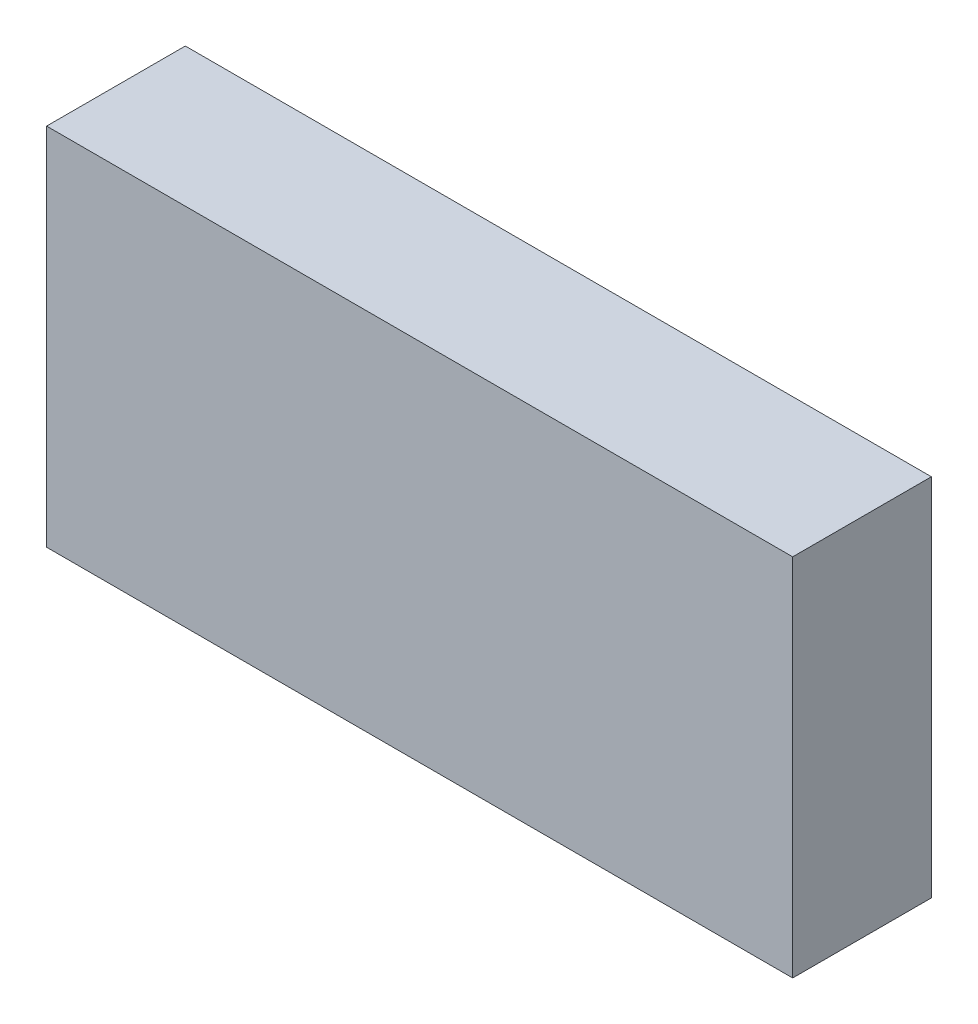
ISO-10303-21;
HEADER;
FILE_DESCRIPTION(('STEP AP214'),'2;1');
FILE_NAME('part.step','',(''),(''),'','','');
FILE_SCHEMA(('AUTOMOTIVE_DESIGN { 1 0 10303 214 1 1 1 1 }'));
ENDSEC;
DATA;
#1=APPLICATION_CONTEXT('core data for automotive mechanical design processes');
#2=APPLICATION_PROTOCOL_DEFINITION('international standard','automotive_design',2000,#1);
#3=PRODUCT_CONTEXT('',#1,'mechanical');
#4=PRODUCT('Part','Part','',(#3));
#5=PRODUCT_RELATED_PRODUCT_CATEGORY('part','',(#4));
#6=PRODUCT_DEFINITION_FORMATION('','',#4);
#7=PRODUCT_DEFINITION_CONTEXT('part definition',#1,'design');
#8=PRODUCT_DEFINITION('design','',#6,#7);
#9=PRODUCT_DEFINITION_SHAPE('','',#8);
#10=(LENGTH_UNIT() NAMED_UNIT(*) SI_UNIT(.MILLI.,.METRE.));
#11=(NAMED_UNIT(*) PLANE_ANGLE_UNIT() SI_UNIT($,.RADIAN.));
#12=(NAMED_UNIT(*) SI_UNIT($,.STERADIAN.) SOLID_ANGLE_UNIT());
#13=UNCERTAINTY_MEASURE_WITH_UNIT(LENGTH_MEASURE(1.E-05),#10,'distance_accuracy_value','');
#14=(GEOMETRIC_REPRESENTATION_CONTEXT(3) GLOBAL_UNCERTAINTY_ASSIGNED_CONTEXT((#13)) GLOBAL_UNIT_ASSIGNED_CONTEXT((#10,
#11,#12)) REPRESENTATION_CONTEXT('',''));
#15=CARTESIAN_POINT('',(0.,0.,0.));
#16=DIRECTION('',(0.,0.,1.));
#17=DIRECTION('',(1.,0.,0.));
#18=AXIS2_PLACEMENT_3D('',#15,#16,#17);
#19=CARTESIAN_POINT('',(1.143,0.5588,0.42499788));
#20=DIRECTION('',(0.,0.,-1.));
#21=DIRECTION('',(0.,-1.,0.));
#22=AXIS2_PLACEMENT_3D('',#19,#20,#21);
#23=PLANE('',#22);
#24=DIRECTION('',(-1.,0.,0.));
#25=VECTOR('',#24,1.);
#26=CARTESIAN_POINT('',(1.143,0.5588,0.42499788));
#27=LINE('',#26,#25);
#28=CARTESIAN_POINT('',(1.143,0.5588,0.42499788));
#29=VERTEX_POINT('',#28);
#30=CARTESIAN_POINT('',(-1.143,0.5588,0.42499788));
#31=VERTEX_POINT('',#30);
#32=EDGE_CURVE('E67',#29,#31,#27,.T.);
#33=ORIENTED_EDGE('',*,*,#32,.T.);
#34=DIRECTION('',(0.,-1.,0.));
#35=VECTOR('',#34,1.);
#36=CARTESIAN_POINT('',(-1.143,0.5588,0.42499788));
#37=LINE('',#36,#35);
#38=CARTESIAN_POINT('',(-1.143,-0.5588,0.42499788));
#39=VERTEX_POINT('',#38);
#40=EDGE_CURVE('E99',#31,#39,#37,.T.);
#41=ORIENTED_EDGE('',*,*,#40,.T.);
#42=DIRECTION('',(1.,0.,0.));
#43=VECTOR('',#42,1.);
#44=CARTESIAN_POINT('',(-1.143,-0.5588,0.42499788));
#45=LINE('',#44,#43);
#46=CARTESIAN_POINT('',(1.143,-0.5588,0.42499788));
#47=VERTEX_POINT('',#46);
#48=EDGE_CURVE('E70',#39,#47,#45,.T.);
#49=ORIENTED_EDGE('',*,*,#48,.T.);
#50=DIRECTION('',(0.,1.,0.));
#51=VECTOR('',#50,1.);
#52=CARTESIAN_POINT('',(1.143,-0.5588,0.42499788));
#53=LINE('',#52,#51);
#54=EDGE_CURVE('E11',#47,#29,#53,.T.);
#55=ORIENTED_EDGE('',*,*,#54,.T.);
#56=EDGE_LOOP('',(#33,#41,#49,#55));
#57=FACE_BOUND('',#56,.T.);
#58=ADVANCED_FACE('F17',(#57),#23,.F.);
#59=CARTESIAN_POINT('',(1.143,0.5588,0.));
#60=DIRECTION('',(0.,0.,-1.));
#61=DIRECTION('',(0.,-1.,0.));
#62=AXIS2_PLACEMENT_3D('',#59,#60,#61);
#63=PLANE('',#62);
#64=DIRECTION('',(-1.,0.,0.));
#65=VECTOR('',#64,1.);
#66=CARTESIAN_POINT('',(1.143,0.5588,0.));
#67=LINE('',#66,#65);
#68=CARTESIAN_POINT('',(1.143,0.5588,0.));
#69=VERTEX_POINT('',#68);
#70=CARTESIAN_POINT('',(-1.143,0.5588,0.));
#71=VERTEX_POINT('',#70);
#72=EDGE_CURVE('E84',#69,#71,#67,.T.);
#73=ORIENTED_EDGE('',*,*,#72,.F.);
#74=DIRECTION('',(0.,1.,0.));
#75=VECTOR('',#74,1.);
#76=CARTESIAN_POINT('',(1.143,-0.5588,0.));
#77=LINE('',#76,#75);
#78=CARTESIAN_POINT('',(1.143,-0.5588,0.));
#79=VERTEX_POINT('',#78);
#80=EDGE_CURVE('E28',#79,#69,#77,.T.);
#81=ORIENTED_EDGE('',*,*,#80,.F.);
#82=DIRECTION('',(1.,0.,0.));
#83=VECTOR('',#82,1.);
#84=CARTESIAN_POINT('',(-1.143,-0.5588,0.));
#85=LINE('',#84,#83);
#86=CARTESIAN_POINT('',(-1.143,-0.5588,0.));
#87=VERTEX_POINT('',#86);
#88=EDGE_CURVE('E93',#87,#79,#85,.T.);
#89=ORIENTED_EDGE('',*,*,#88,.F.);
#90=DIRECTION('',(0.,-1.,0.));
#91=VECTOR('',#90,1.);
#92=CARTESIAN_POINT('',(-1.143,0.5588,0.));
#93=LINE('',#92,#91);
#94=EDGE_CURVE('E80',#71,#87,#93,.T.);
#95=ORIENTED_EDGE('',*,*,#94,.F.);
#96=EDGE_LOOP('',(#73,#81,#89,#95));
#97=FACE_BOUND('',#96,.T.);
#98=ADVANCED_FACE('F156',(#97),#63,.T.);
#99=CARTESIAN_POINT('',(1.143,-0.5588,0.));
#100=DIRECTION('',(-1.,0.,0.));
#101=DIRECTION('',(0.,0.,1.));
#102=AXIS2_PLACEMENT_3D('',#99,#100,#101);
#103=PLANE('',#102);
#104=DIRECTION('',(0.,0.,1.));
#105=VECTOR('',#104,1.);
#106=CARTESIAN_POINT('',(1.143,-0.5588,0.));
#107=LINE('',#106,#105);
#108=EDGE_CURVE('E21',#79,#47,#107,.T.);
#109=ORIENTED_EDGE('',*,*,#108,.F.);
#110=ORIENTED_EDGE('',*,*,#80,.T.);
#111=DIRECTION('',(0.,0.,1.));
#112=VECTOR('',#111,1.);
#113=CARTESIAN_POINT('',(1.143,0.5588,0.));
#114=LINE('',#113,#112);
#115=EDGE_CURVE('E76',#69,#29,#114,.T.);
#116=ORIENTED_EDGE('',*,*,#115,.T.);
#117=ORIENTED_EDGE('',*,*,#54,.F.);
#118=EDGE_LOOP('',(#109,#110,#116,#117));
#119=FACE_BOUND('',#118,.T.);
#120=ADVANCED_FACE('F81',(#119),#103,.F.);
#121=CARTESIAN_POINT('',(-1.143,-0.5588,0.));
#122=DIRECTION('',(0.,1.,0.));
#123=DIRECTION('',(1.,0.,0.));
#124=AXIS2_PLACEMENT_3D('',#121,#122,#123);
#125=PLANE('',#124);
#126=DIRECTION('',(0.,0.,1.));
#127=VECTOR('',#126,1.);
#128=CARTESIAN_POINT('',(-1.143,-0.5588,0.));
#129=LINE('',#128,#127);
#130=EDGE_CURVE('E97',#87,#39,#129,.T.);
#131=ORIENTED_EDGE('',*,*,#130,.F.);
#132=ORIENTED_EDGE('',*,*,#88,.T.);
#133=ORIENTED_EDGE('',*,*,#108,.T.);
#134=ORIENTED_EDGE('',*,*,#48,.F.);
#135=EDGE_LOOP('',(#131,#132,#133,#134));
#136=FACE_BOUND('',#135,.T.);
#137=ADVANCED_FACE('F19',(#136),#125,.F.);
#138=CARTESIAN_POINT('',(-1.143,0.5588,0.));
#139=DIRECTION('',(1.,0.,0.));
#140=DIRECTION('',(0.,1.,0.));
#141=AXIS2_PLACEMENT_3D('',#138,#139,#140);
#142=PLANE('',#141);
#143=DIRECTION('',(0.,0.,1.));
#144=VECTOR('',#143,1.);
#145=CARTESIAN_POINT('',(-1.143,0.5588,0.));
#146=LINE('',#145,#144);
#147=EDGE_CURVE('E78',#71,#31,#146,.T.);
#148=ORIENTED_EDGE('',*,*,#147,.F.);
#149=ORIENTED_EDGE('',*,*,#94,.T.);
#150=ORIENTED_EDGE('',*,*,#130,.T.);
#151=ORIENTED_EDGE('',*,*,#40,.F.);
#152=EDGE_LOOP('',(#148,#149,#150,#151));
#153=FACE_BOUND('',#152,.T.);
#154=ADVANCED_FACE('F152',(#153),#142,.F.);
#155=CARTESIAN_POINT('',(1.143,0.5588,0.));
#156=DIRECTION('',(0.,-1.,0.));
#157=DIRECTION('',(0.,0.,-1.));
#158=AXIS2_PLACEMENT_3D('',#155,#156,#157);
#159=PLANE('',#158);
#160=ORIENTED_EDGE('',*,*,#115,.F.);
#161=ORIENTED_EDGE('',*,*,#72,.T.);
#162=ORIENTED_EDGE('',*,*,#147,.T.);
#163=ORIENTED_EDGE('',*,*,#32,.F.);
#164=EDGE_LOOP('',(#160,#161,#162,#163));
#165=FACE_BOUND('',#164,.T.);
#166=ADVANCED_FACE('F74',(#165),#159,.F.);
#167=CLOSED_SHELL('',(#58,#98,#120,#137,#154,#166));
#168=MANIFOLD_SOLID_BREP('B1',#167);
#169=ADVANCED_BREP_SHAPE_REPRESENTATION('',(#18,#168),#14);
#170=SHAPE_DEFINITION_REPRESENTATION(#9,#169);
ENDSEC;
END-ISO-10303-21;
